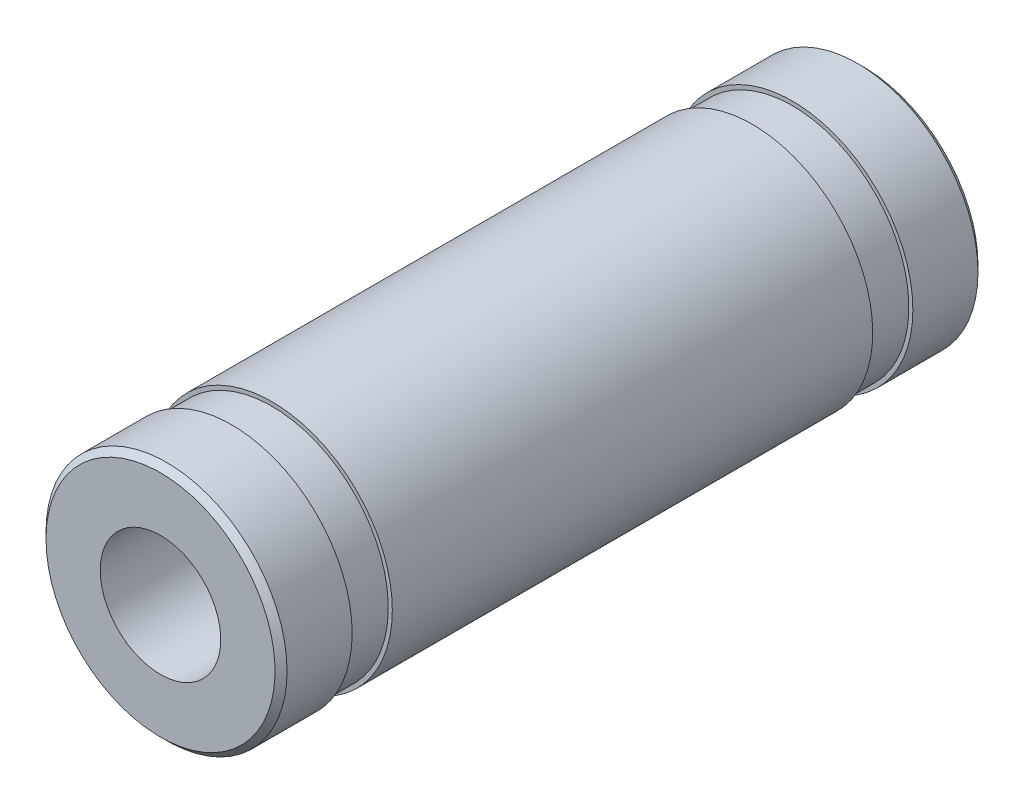
ISO-10303-21;
HEADER;
FILE_DESCRIPTION(('STEP AP214'),'2;1');
FILE_NAME('part.step','',(''),(''),'','','');
FILE_SCHEMA(('AUTOMOTIVE_DESIGN { 1 0 10303 214 1 1 1 1 }'));
ENDSEC;
DATA;
#1=APPLICATION_CONTEXT('core data for automotive mechanical design processes');
#2=APPLICATION_PROTOCOL_DEFINITION('international standard','automotive_design',2000,#1);
#3=PRODUCT_CONTEXT('',#1,'mechanical');
#4=PRODUCT('Part','Part','',(#3));
#5=PRODUCT_RELATED_PRODUCT_CATEGORY('part','',(#4));
#6=PRODUCT_DEFINITION_FORMATION('','',#4);
#7=PRODUCT_DEFINITION_CONTEXT('part definition',#1,'design');
#8=PRODUCT_DEFINITION('design','',#6,#7);
#9=PRODUCT_DEFINITION_SHAPE('','',#8);
#10=(LENGTH_UNIT() NAMED_UNIT(*) SI_UNIT(.MILLI.,.METRE.));
#11=(NAMED_UNIT(*) PLANE_ANGLE_UNIT() SI_UNIT($,.RADIAN.));
#12=(NAMED_UNIT(*) SI_UNIT($,.STERADIAN.) SOLID_ANGLE_UNIT());
#13=UNCERTAINTY_MEASURE_WITH_UNIT(LENGTH_MEASURE(1.E-05),#10,'distance_accuracy_value','');
#14=(GEOMETRIC_REPRESENTATION_CONTEXT(3) GLOBAL_UNCERTAINTY_ASSIGNED_CONTEXT((#13)) GLOBAL_UNIT_ASSIGNED_CONTEXT((#10,
#11,#12)) REPRESENTATION_CONTEXT('',''));
#15=CARTESIAN_POINT('',(0.,0.,0.));
#16=DIRECTION('',(0.,0.,1.));
#17=DIRECTION('',(1.,0.,0.));
#18=AXIS2_PLACEMENT_3D('',#15,#16,#17);
#19=CARTESIAN_POINT('',(0.,0.,17.5));
#20=DIRECTION('',(0.,0.,-1.));
#21=DIRECTION('',(-1.,0.,0.));
#22=AXIS2_PLACEMENT_3D('',#19,#20,#21);
#23=CYLINDRICAL_SURFACE('',#22,3.);
#24=CARTESIAN_POINT('',(0.,0.,-17.5));
#25=DIRECTION('',(0.,0.,-1.));
#26=DIRECTION('',(-1.,0.,0.));
#27=AXIS2_PLACEMENT_3D('',#24,#25,#26);
#28=CIRCLE('',#27,3.);
#29=CARTESIAN_POINT('',(-3.,0.,-17.5));
#30=VERTEX_POINT('',#29);
#31=EDGE_CURVE('E18',#30,#30,#28,.T.);
#32=ORIENTED_EDGE('',*,*,#31,.T.);
#33=EDGE_LOOP('',(#32));
#34=FACE_BOUND('',#33,.T.);
#35=CARTESIAN_POINT('',(0.,0.,17.5));
#36=DIRECTION('',(0.,0.,-1.));
#37=DIRECTION('',(-1.,0.,0.));
#38=AXIS2_PLACEMENT_3D('',#35,#36,#37);
#39=CIRCLE('',#38,3.);
#40=CARTESIAN_POINT('',(-3.,0.,17.5));
#41=VERTEX_POINT('',#40);
#42=EDGE_CURVE('E57',#41,#41,#39,.T.);
#43=ORIENTED_EDGE('',*,*,#42,.F.);
#44=EDGE_LOOP('',(#43));
#45=FACE_BOUND('',#44,.T.);
#46=ADVANCED_FACE('F15',(#34,#45),#23,.F.);
#47=CARTESIAN_POINT('',(0.,0.,-17.5));
#48=DIRECTION('',(0.,0.,1.));
#49=DIRECTION('',(1.,0.,0.));
#50=AXIS2_PLACEMENT_3D('',#47,#48,#49);
#51=PLANE('',#50);
#52=ORIENTED_EDGE('',*,*,#31,.F.);
#53=EDGE_LOOP('',(#52));
#54=FACE_BOUND('',#53,.T.);
#55=CARTESIAN_POINT('',(0.,0.,-17.4999999999272));
#56=DIRECTION('',(0.,0.,1.));
#57=DIRECTION('',(1.,0.,0.));
#58=AXIS2_PLACEMENT_3D('',#55,#56,#57);
#59=CIRCLE('',#58,5.69999999999027);
#60=CARTESIAN_POINT('',(5.69999999999027,0.,-17.4999999999272));
#61=VERTEX_POINT('',#60);
#62=EDGE_CURVE('E55',#61,#61,#59,.T.);
#63=ORIENTED_EDGE('',*,*,#62,.F.);
#64=EDGE_LOOP('',(#63));
#65=FACE_BOUND('',#64,.T.);
#66=ADVANCED_FACE('F66',(#54,#65),#51,.F.);
#67=CARTESIAN_POINT('',(0.,0.,17.5));
#68=DIRECTION('',(0.,0.,1.));
#69=DIRECTION('',(1.,0.,0.));
#70=AXIS2_PLACEMENT_3D('',#67,#68,#69);
#71=PLANE('',#70);
#72=ORIENTED_EDGE('',*,*,#42,.T.);
#73=EDGE_LOOP('',(#72));
#74=FACE_BOUND('',#73,.T.);
#75=CARTESIAN_POINT('',(0.,0.,17.4999999999841));
#76=DIRECTION('',(0.,0.,-1.));
#77=DIRECTION('',(-1.,0.,0.));
#78=AXIS2_PLACEMENT_3D('',#75,#76,#77);
#79=CIRCLE('',#78,5.69999999999027);
#80=CARTESIAN_POINT('',(-5.69999999999027,0.,17.4999999999841));
#81=VERTEX_POINT('',#80);
#82=EDGE_CURVE('E51',#81,#81,#79,.T.);
#83=ORIENTED_EDGE('',*,*,#82,.F.);
#84=EDGE_LOOP('',(#83));
#85=FACE_BOUND('',#84,.T.);
#86=ADVANCED_FACE('F69',(#74,#85),#71,.T.);
#87=CARTESIAN_POINT('',(0.,0.,-17.1999999999457));
#88=DIRECTION('',(0.,0.,1.));
#89=DIRECTION('',(1.,0.,0.));
#90=AXIS2_PLACEMENT_3D('',#87,#88,#89);
#91=CONICAL_SURFACE('',#90,5.99999999997181,0.785398163397448);
#92=CARTESIAN_POINT('',(0.,0.,-17.2));
#93=DIRECTION('',(0.,0.,-1.));
#94=DIRECTION('',(-1.,0.,0.));
#95=AXIS2_PLACEMENT_3D('',#92,#93,#94);
#96=CIRCLE('',#95,6.);
#97=CARTESIAN_POINT('',(-6.,0.,-17.2));
#98=VERTEX_POINT('',#97);
#99=EDGE_CURVE('E54',#98,#98,#96,.F.);
#100=ORIENTED_EDGE('',*,*,#99,.F.);
#101=EDGE_LOOP('',(#100));
#102=FACE_BOUND('',#101,.T.);
#103=ORIENTED_EDGE('',*,*,#62,.T.);
#104=EDGE_LOOP('',(#103));
#105=FACE_BOUND('',#104,.T.);
#106=ADVANCED_FACE('F72',(#102,#105),#91,.T.);
#107=CARTESIAN_POINT('',(0.,0.,17.2000000000025));
#108=DIRECTION('',(0.,0.,-1.));
#109=DIRECTION('',(-1.,0.,0.));
#110=AXIS2_PLACEMENT_3D('',#107,#108,#109);
#111=CONICAL_SURFACE('',#110,5.99999999991496,0.785398163302709);
#112=ORIENTED_EDGE('',*,*,#82,.T.);
#113=EDGE_LOOP('',(#112));
#114=FACE_BOUND('',#113,.T.);
#115=CARTESIAN_POINT('',(0.,0.,17.2));
#116=DIRECTION('',(0.,0.,-1.));
#117=DIRECTION('',(-1.,0.,0.));
#118=AXIS2_PLACEMENT_3D('',#115,#116,#117);
#119=CIRCLE('',#118,6.);
#120=CARTESIAN_POINT('',(-6.,0.,17.2));
#121=VERTEX_POINT('',#120);
#122=EDGE_CURVE('E50',#121,#121,#119,.T.);
#123=ORIENTED_EDGE('',*,*,#122,.F.);
#124=EDGE_LOOP('',(#123));
#125=FACE_BOUND('',#124,.T.);
#126=ADVANCED_FACE('F74',(#114,#125),#111,.T.);
#127=CARTESIAN_POINT('',(0.,0.,17.5));
#128=DIRECTION('',(0.,0.,-1.));
#129=DIRECTION('',(-1.,0.,0.));
#130=AXIS2_PLACEMENT_3D('',#127,#128,#129);
#131=CYLINDRICAL_SURFACE('',#130,6.);
#132=CARTESIAN_POINT('',(0.,0.,-13.9574057767546));
#133=DIRECTION('',(0.,0.,-1.));
#134=DIRECTION('',(-1.,0.,0.));
#135=AXIS2_PLACEMENT_3D('',#132,#133,#134);
#136=CIRCLE('',#135,6.);
#137=CARTESIAN_POINT('',(-6.,0.,-13.9574057767546));
#138=VERTEX_POINT('',#137);
#139=EDGE_CURVE('E47',#138,#138,#136,.T.);
#140=ORIENTED_EDGE('',*,*,#139,.T.);
#141=EDGE_LOOP('',(#140));
#142=FACE_BOUND('',#141,.T.);
#143=ORIENTED_EDGE('',*,*,#99,.T.);
#144=EDGE_LOOP('',(#143));
#145=FACE_BOUND('',#144,.T.);
#146=ADVANCED_FACE('F82',(#142,#145),#131,.T.);
#147=CARTESIAN_POINT('',(0.,0.,17.5));
#148=DIRECTION('',(0.,0.,-1.));
#149=DIRECTION('',(-1.,0.,0.));
#150=AXIS2_PLACEMENT_3D('',#147,#148,#149);
#151=CYLINDRICAL_SURFACE('',#150,6.);
#152=CARTESIAN_POINT('',(0.,0.,13.9574057767546));
#153=DIRECTION('',(0.,0.,-1.));
#154=DIRECTION('',(-1.,0.,0.));
#155=AXIS2_PLACEMENT_3D('',#152,#153,#154);
#156=CIRCLE('',#155,6.);
#157=CARTESIAN_POINT('',(-6.,0.,13.9574057767546));
#158=VERTEX_POINT('',#157);
#159=EDGE_CURVE('E44',#158,#158,#156,.F.);
#160=ORIENTED_EDGE('',*,*,#159,.T.);
#161=EDGE_LOOP('',(#160));
#162=FACE_BOUND('',#161,.T.);
#163=ORIENTED_EDGE('',*,*,#122,.T.);
#164=EDGE_LOOP('',(#163));
#165=FACE_BOUND('',#164,.T.);
#166=ADVANCED_FACE('F117',(#162,#165),#151,.T.);
#167=CARTESIAN_POINT('',(0.,6.,-13.9574057767546));
#168=DIRECTION('',(0.,0.,-1.));
#169=DIRECTION('',(-1.,0.,0.));
#170=AXIS2_PLACEMENT_3D('',#167,#168,#169);
#171=PLANE('',#170);
#172=CARTESIAN_POINT('',(0.,0.,-13.9574057767546));
#173=DIRECTION('',(0.,0.,-1.));
#174=DIRECTION('',(-1.,0.,0.));
#175=AXIS2_PLACEMENT_3D('',#172,#173,#174);
#176=CIRCLE('',#175,5.8);
#177=CARTESIAN_POINT('',(-5.8,0.,-13.9574057767546));
#178=VERTEX_POINT('',#177);
#179=EDGE_CURVE('E41',#178,#178,#176,.F.);
#180=ORIENTED_EDGE('',*,*,#179,.F.);
#181=EDGE_LOOP('',(#180));
#182=FACE_BOUND('',#181,.T.);
#183=ORIENTED_EDGE('',*,*,#139,.F.);
#184=EDGE_LOOP('',(#183));
#185=FACE_BOUND('',#184,.T.);
#186=ADVANCED_FACE('F113',(#182,#185),#171,.F.);
#187=CARTESIAN_POINT('',(0.,6.,13.9574057767546));
#188=DIRECTION('',(0.,0.,1.));
#189=DIRECTION('',(1.,0.,0.));
#190=AXIS2_PLACEMENT_3D('',#187,#188,#189);
#191=PLANE('',#190);
#192=ORIENTED_EDGE('',*,*,#159,.F.);
#193=EDGE_LOOP('',(#192));
#194=FACE_BOUND('',#193,.T.);
#195=CARTESIAN_POINT('',(0.,0.,13.9574057767546));
#196=DIRECTION('',(0.,0.,-1.));
#197=DIRECTION('',(-1.,0.,0.));
#198=AXIS2_PLACEMENT_3D('',#195,#196,#197);
#199=CIRCLE('',#198,5.8);
#200=CARTESIAN_POINT('',(-5.8,0.,13.9574057767546));
#201=VERTEX_POINT('',#200);
#202=EDGE_CURVE('E38',#201,#201,#199,.T.);
#203=ORIENTED_EDGE('',*,*,#202,.F.);
#204=EDGE_LOOP('',(#203));
#205=FACE_BOUND('',#204,.T.);
#206=ADVANCED_FACE('F109',(#194,#205),#191,.F.);
#207=CARTESIAN_POINT('',(0.,0.,0.));
#208=DIRECTION('',(0.,0.,-1.));
#209=DIRECTION('',(-1.,0.,0.));
#210=AXIS2_PLACEMENT_3D('',#207,#208,#209);
#211=CYLINDRICAL_SURFACE('',#210,5.8);
#212=CARTESIAN_POINT('',(0.,0.,-11.9584808288274));
#213=DIRECTION('',(0.,0.,-1.));
#214=DIRECTION('',(-1.,0.,0.));
#215=AXIS2_PLACEMENT_3D('',#212,#213,#214);
#216=CIRCLE('',#215,5.8);
#217=CARTESIAN_POINT('',(-5.8,0.,-11.9584808288274));
#218=VERTEX_POINT('',#217);
#219=EDGE_CURVE('E35',#218,#218,#216,.T.);
#220=ORIENTED_EDGE('',*,*,#219,.T.);
#221=EDGE_LOOP('',(#220));
#222=FACE_BOUND('',#221,.T.);
#223=ORIENTED_EDGE('',*,*,#179,.T.);
#224=EDGE_LOOP('',(#223));
#225=FACE_BOUND('',#224,.T.);
#226=ADVANCED_FACE('F105',(#222,#225),#211,.T.);
#227=CARTESIAN_POINT('',(0.,0.,0.));
#228=DIRECTION('',(0.,0.,-1.));
#229=DIRECTION('',(-1.,0.,0.));
#230=AXIS2_PLACEMENT_3D('',#227,#228,#229);
#231=CYLINDRICAL_SURFACE('',#230,5.8);
#232=ORIENTED_EDGE('',*,*,#202,.T.);
#233=EDGE_LOOP('',(#232));
#234=FACE_BOUND('',#233,.T.);
#235=CARTESIAN_POINT('',(0.,0.,11.9584808288274));
#236=DIRECTION('',(0.,0.,-1.));
#237=DIRECTION('',(-1.,0.,0.));
#238=AXIS2_PLACEMENT_3D('',#235,#236,#237);
#239=CIRCLE('',#238,5.8);
#240=CARTESIAN_POINT('',(-5.8,0.,11.9584808288274));
#241=VERTEX_POINT('',#240);
#242=EDGE_CURVE('E27',#241,#241,#239,.F.);
#243=ORIENTED_EDGE('',*,*,#242,.T.);
#244=EDGE_LOOP('',(#243));
#245=FACE_BOUND('',#244,.T.);
#246=ADVANCED_FACE('F101',(#234,#245),#231,.T.);
#247=CARTESIAN_POINT('',(0.,6.,-11.9584808288274));
#248=DIRECTION('',(0.,0.,1.));
#249=DIRECTION('',(1.,0.,0.));
#250=AXIS2_PLACEMENT_3D('',#247,#248,#249);
#251=PLANE('',#250);
#252=CARTESIAN_POINT('',(0.,0.,-11.9584808288274));
#253=DIRECTION('',(0.,0.,-1.));
#254=DIRECTION('',(-1.,0.,0.));
#255=AXIS2_PLACEMENT_3D('',#252,#253,#254);
#256=CIRCLE('',#255,6.);
#257=CARTESIAN_POINT('',(-6.,0.,-11.9584808288274));
#258=VERTEX_POINT('',#257);
#259=EDGE_CURVE('E22',#258,#258,#256,.F.);
#260=ORIENTED_EDGE('',*,*,#259,.F.);
#261=EDGE_LOOP('',(#260));
#262=FACE_BOUND('',#261,.T.);
#263=ORIENTED_EDGE('',*,*,#219,.F.);
#264=EDGE_LOOP('',(#263));
#265=FACE_BOUND('',#264,.T.);
#266=ADVANCED_FACE('F94',(#262,#265),#251,.F.);
#267=CARTESIAN_POINT('',(0.,6.,11.9584808288274));
#268=DIRECTION('',(0.,0.,-1.));
#269=DIRECTION('',(-1.,0.,0.));
#270=AXIS2_PLACEMENT_3D('',#267,#268,#269);
#271=PLANE('',#270);
#272=ORIENTED_EDGE('',*,*,#242,.F.);
#273=EDGE_LOOP('',(#272));
#274=FACE_BOUND('',#273,.T.);
#275=CARTESIAN_POINT('',(0.,0.,11.9584808288274));
#276=DIRECTION('',(0.,0.,-1.));
#277=DIRECTION('',(-1.,0.,0.));
#278=AXIS2_PLACEMENT_3D('',#275,#276,#277);
#279=CIRCLE('',#278,6.);
#280=CARTESIAN_POINT('',(-6.,0.,11.9584808288274));
#281=VERTEX_POINT('',#280);
#282=EDGE_CURVE('E9',#281,#281,#279,.T.);
#283=ORIENTED_EDGE('',*,*,#282,.F.);
#284=EDGE_LOOP('',(#283));
#285=FACE_BOUND('',#284,.T.);
#286=ADVANCED_FACE('F89',(#274,#285),#271,.F.);
#287=CARTESIAN_POINT('',(0.,0.,17.5));
#288=DIRECTION('',(0.,0.,-1.));
#289=DIRECTION('',(-1.,0.,0.));
#290=AXIS2_PLACEMENT_3D('',#287,#288,#289);
#291=CYLINDRICAL_SURFACE('',#290,6.);
#292=ORIENTED_EDGE('',*,*,#282,.T.);
#293=EDGE_LOOP('',(#292));
#294=FACE_BOUND('',#293,.T.);
#295=ORIENTED_EDGE('',*,*,#259,.T.);
#296=EDGE_LOOP('',(#295));
#297=FACE_BOUND('',#296,.T.);
#298=ADVANCED_FACE('F87',(#294,#297),#291,.T.);
#299=CLOSED_SHELL('',(#46,#66,#86,#106,#126,#146,#166,#186,#206,#226,#246,#266,#286,#298));
#300=MANIFOLD_SOLID_BREP('B1',#299);
#301=ADVANCED_BREP_SHAPE_REPRESENTATION('',(#18,#300),#14);
#302=SHAPE_DEFINITION_REPRESENTATION(#9,#301);
ENDSEC;
END-ISO-10303-21;
